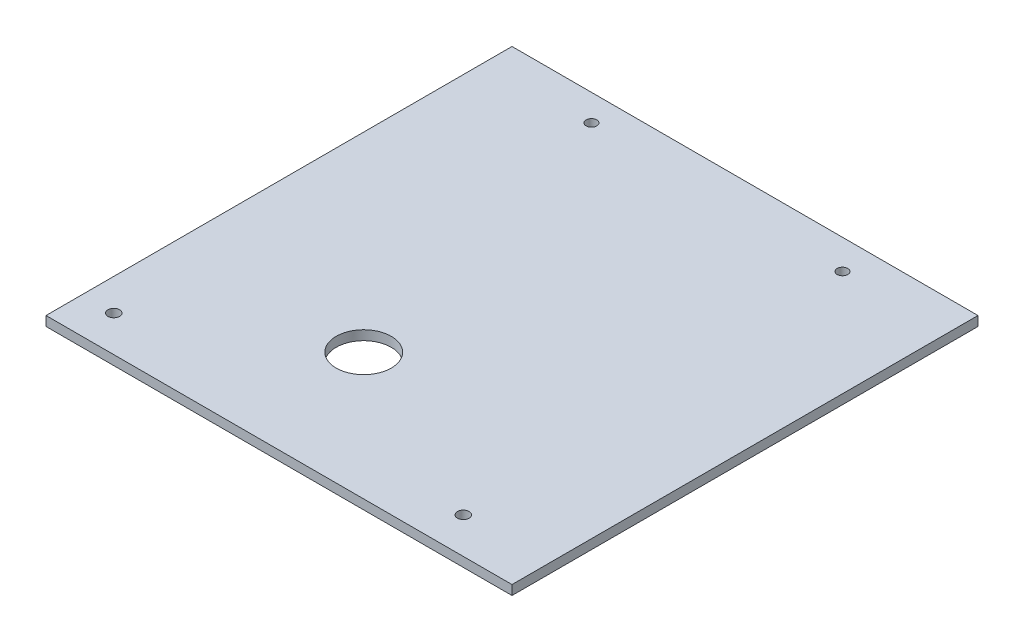
ISO-10303-21;
HEADER;
FILE_DESCRIPTION(('STEP AP214'),'2;1');
FILE_NAME('part.step','',(''),(''),'','','');
FILE_SCHEMA(('AUTOMOTIVE_DESIGN { 1 0 10303 214 1 1 1 1 }'));
ENDSEC;
DATA;
#1=APPLICATION_CONTEXT('core data for automotive mechanical design processes');
#2=APPLICATION_PROTOCOL_DEFINITION('international standard','automotive_design',2000,#1);
#3=PRODUCT_CONTEXT('',#1,'mechanical');
#4=PRODUCT('Part','Part','',(#3));
#5=PRODUCT_RELATED_PRODUCT_CATEGORY('part','',(#4));
#6=PRODUCT_DEFINITION_FORMATION('','',#4);
#7=PRODUCT_DEFINITION_CONTEXT('part definition',#1,'design');
#8=PRODUCT_DEFINITION('design','',#6,#7);
#9=PRODUCT_DEFINITION_SHAPE('','',#8);
#10=(LENGTH_UNIT() NAMED_UNIT(*) SI_UNIT(.MILLI.,.METRE.));
#11=(NAMED_UNIT(*) PLANE_ANGLE_UNIT() SI_UNIT($,.RADIAN.));
#12=(NAMED_UNIT(*) SI_UNIT($,.STERADIAN.) SOLID_ANGLE_UNIT());
#13=UNCERTAINTY_MEASURE_WITH_UNIT(LENGTH_MEASURE(1.E-05),#10,'distance_accuracy_value','');
#14=(GEOMETRIC_REPRESENTATION_CONTEXT(3) GLOBAL_UNCERTAINTY_ASSIGNED_CONTEXT((#13)) GLOBAL_UNIT_ASSIGNED_CONTEXT((#10,
#11,#12)) REPRESENTATION_CONTEXT('',''));
#15=CARTESIAN_POINT('',(0.,0.,0.));
#16=DIRECTION('',(0.,0.,1.));
#17=DIRECTION('',(1.,0.,0.));
#18=AXIS2_PLACEMENT_3D('',#15,#16,#17);
#19=CARTESIAN_POINT('',(110.,4.5,110.));
#20=DIRECTION('',(-1.,0.,0.));
#21=DIRECTION('',(0.,0.,1.));
#22=AXIS2_PLACEMENT_3D('',#19,#20,#21);
#23=PLANE('',#22);
#24=DIRECTION('',(0.,0.,-1.));
#25=VECTOR('',#24,1.);
#26=CARTESIAN_POINT('',(110.,0.,110.));
#27=LINE('',#26,#25);
#28=CARTESIAN_POINT('',(110.,0.,110.));
#29=VERTEX_POINT('',#28);
#30=CARTESIAN_POINT('',(110.,0.,-110.));
#31=VERTEX_POINT('',#30);
#32=EDGE_CURVE('E107',#29,#31,#27,.T.);
#33=ORIENTED_EDGE('',*,*,#32,.T.);
#34=DIRECTION('',(0.,-1.,0.));
#35=VECTOR('',#34,1.);
#36=CARTESIAN_POINT('',(110.,4.5,-110.));
#37=LINE('',#36,#35);
#38=CARTESIAN_POINT('',(110.,4.5,-110.));
#39=VERTEX_POINT('',#38);
#40=EDGE_CURVE('E13',#39,#31,#37,.T.);
#41=ORIENTED_EDGE('',*,*,#40,.F.);
#42=DIRECTION('',(0.,0.,-1.));
#43=VECTOR('',#42,1.);
#44=CARTESIAN_POINT('',(110.,4.5,110.));
#45=LINE('',#44,#43);
#46=CARTESIAN_POINT('',(110.,4.5,110.));
#47=VERTEX_POINT('',#46);
#48=EDGE_CURVE('E95',#47,#39,#45,.T.);
#49=ORIENTED_EDGE('',*,*,#48,.F.);
#50=DIRECTION('',(0.,-1.,0.));
#51=VECTOR('',#50,1.);
#52=CARTESIAN_POINT('',(110.,4.5,110.));
#53=LINE('',#52,#51);
#54=EDGE_CURVE('E103',#47,#29,#53,.T.);
#55=ORIENTED_EDGE('',*,*,#54,.T.);
#56=EDGE_LOOP('',(#33,#41,#49,#55));
#57=FACE_BOUND('',#56,.T.);
#58=ADVANCED_FACE('F44',(#57),#23,.F.);
#59=CARTESIAN_POINT('',(-110.,4.5,-110.));
#60=DIRECTION('',(0.,0.,1.));
#61=DIRECTION('',(1.,0.,0.));
#62=AXIS2_PLACEMENT_3D('',#59,#60,#61);
#63=PLANE('',#62);
#64=DIRECTION('',(-1.,0.,0.));
#65=VECTOR('',#64,1.);
#66=CARTESIAN_POINT('',(-110.,0.,-110.));
#67=LINE('',#66,#65);
#68=CARTESIAN_POINT('',(-110.,0.,-110.));
#69=VERTEX_POINT('',#68);
#70=EDGE_CURVE('E99',#31,#69,#67,.T.);
#71=ORIENTED_EDGE('',*,*,#70,.T.);
#72=DIRECTION('',(0.,-1.,0.));
#73=VECTOR('',#72,1.);
#74=CARTESIAN_POINT('',(-110.,4.5,-110.));
#75=LINE('',#74,#73);
#76=CARTESIAN_POINT('',(-110.,4.5,-110.));
#77=VERTEX_POINT('',#76);
#78=EDGE_CURVE('E52',#77,#69,#75,.T.);
#79=ORIENTED_EDGE('',*,*,#78,.F.);
#80=DIRECTION('',(-1.,0.,0.));
#81=VECTOR('',#80,1.);
#82=CARTESIAN_POINT('',(-110.,4.5,-110.));
#83=LINE('',#82,#81);
#84=EDGE_CURVE('E90',#39,#77,#83,.T.);
#85=ORIENTED_EDGE('',*,*,#84,.F.);
#86=ORIENTED_EDGE('',*,*,#40,.T.);
#87=EDGE_LOOP('',(#71,#79,#85,#86));
#88=FACE_BOUND('',#87,.T.);
#89=ADVANCED_FACE('F98',(#88),#63,.F.);
#90=CARTESIAN_POINT('',(-110.,4.5,110.));
#91=DIRECTION('',(1.,0.,0.));
#92=DIRECTION('',(0.,0.,-1.));
#93=AXIS2_PLACEMENT_3D('',#90,#91,#92);
#94=PLANE('',#93);
#95=DIRECTION('',(0.,0.,1.));
#96=VECTOR('',#95,1.);
#97=CARTESIAN_POINT('',(-110.,0.,110.));
#98=LINE('',#97,#96);
#99=CARTESIAN_POINT('',(-110.,0.,110.));
#100=VERTEX_POINT('',#99);
#101=EDGE_CURVE('E77',#69,#100,#98,.T.);
#102=ORIENTED_EDGE('',*,*,#101,.T.);
#103=DIRECTION('',(0.,-1.,0.));
#104=VECTOR('',#103,1.);
#105=CARTESIAN_POINT('',(-110.,4.5,110.));
#106=LINE('',#105,#104);
#107=CARTESIAN_POINT('',(-110.,4.5,110.));
#108=VERTEX_POINT('',#107);
#109=EDGE_CURVE('E100',#108,#100,#106,.T.);
#110=ORIENTED_EDGE('',*,*,#109,.F.);
#111=DIRECTION('',(0.,0.,1.));
#112=VECTOR('',#111,1.);
#113=CARTESIAN_POINT('',(-110.,4.5,110.));
#114=LINE('',#113,#112);
#115=EDGE_CURVE('E93',#77,#108,#114,.T.);
#116=ORIENTED_EDGE('',*,*,#115,.F.);
#117=ORIENTED_EDGE('',*,*,#78,.T.);
#118=EDGE_LOOP('',(#102,#110,#116,#117));
#119=FACE_BOUND('',#118,.T.);
#120=ADVANCED_FACE('F101',(#119),#94,.F.);
#121=CARTESIAN_POINT('',(-110.,4.5,110.));
#122=DIRECTION('',(0.,0.,-1.));
#123=DIRECTION('',(-1.,0.,0.));
#124=AXIS2_PLACEMENT_3D('',#121,#122,#123);
#125=PLANE('',#124);
#126=DIRECTION('',(1.,0.,0.));
#127=VECTOR('',#126,1.);
#128=CARTESIAN_POINT('',(-110.,0.,110.));
#129=LINE('',#128,#127);
#130=EDGE_CURVE('E83',#100,#29,#129,.T.);
#131=ORIENTED_EDGE('',*,*,#130,.T.);
#132=ORIENTED_EDGE('',*,*,#54,.F.);
#133=DIRECTION('',(1.,0.,0.));
#134=VECTOR('',#133,1.);
#135=CARTESIAN_POINT('',(-110.,4.5,110.));
#136=LINE('',#135,#134);
#137=EDGE_CURVE('E60',#108,#47,#136,.T.);
#138=ORIENTED_EDGE('',*,*,#137,.F.);
#139=ORIENTED_EDGE('',*,*,#109,.T.);
#140=EDGE_LOOP('',(#131,#132,#138,#139));
#141=FACE_BOUND('',#140,.T.);
#142=ADVANCED_FACE('F123',(#141),#125,.F.);
#143=CARTESIAN_POINT('',(0.,4.5,0.));
#144=DIRECTION('',(0.,-1.,0.));
#145=DIRECTION('',(0.,0.,-1.));
#146=AXIS2_PLACEMENT_3D('',#143,#144,#145);
#147=PLANE('',#146);
#148=CARTESIAN_POINT('',(-60.,4.5,-97.5));
#149=DIRECTION('',(0.,-1.,0.));
#150=DIRECTION('',(0.,0.,-1.));
#151=AXIS2_PLACEMENT_3D('',#148,#149,#150);
#152=CIRCLE('',#151,2.5);
#153=CARTESIAN_POINT('',(-60.,4.5,-100.));
#154=VERTEX_POINT('',#153);
#155=EDGE_CURVE('E152',#154,#154,#152,.F.);
#156=ORIENTED_EDGE('',*,*,#155,.F.);
#157=EDGE_LOOP('',(#156));
#158=FACE_BOUND('',#157,.T.);
#159=CARTESIAN_POINT('',(60.0000000000001,4.5,-96.));
#160=DIRECTION('',(0.,-1.,0.));
#161=DIRECTION('',(0.,0.,-1.));
#162=AXIS2_PLACEMENT_3D('',#159,#160,#161);
#163=CIRCLE('',#162,2.5);
#164=CARTESIAN_POINT('',(60.0000000000001,4.5,-98.5));
#165=VERTEX_POINT('',#164);
#166=EDGE_CURVE('E144',#165,#165,#163,.F.);
#167=ORIENTED_EDGE('',*,*,#166,.F.);
#168=EDGE_LOOP('',(#167));
#169=FACE_BOUND('',#168,.T.);
#170=CARTESIAN_POINT('',(70.,4.5,93.));
#171=DIRECTION('',(0.,1.,0.));
#172=DIRECTION('',(0.,0.,1.));
#173=AXIS2_PLACEMENT_3D('',#170,#171,#172);
#174=CIRCLE('',#173,2.75000000000001);
#175=CARTESIAN_POINT('',(70.,4.5,95.75));
#176=VERTEX_POINT('',#175);
#177=EDGE_CURVE('E138',#176,#176,#174,.T.);
#178=ORIENTED_EDGE('',*,*,#177,.F.);
#179=EDGE_LOOP('',(#178));
#180=FACE_BOUND('',#179,.T.);
#181=CARTESIAN_POINT('',(-95.,4.5,93.));
#182=DIRECTION('',(0.,1.,0.));
#183=DIRECTION('',(0.,0.,1.));
#184=AXIS2_PLACEMENT_3D('',#181,#182,#183);
#185=CIRCLE('',#184,2.75000000000001);
#186=CARTESIAN_POINT('',(-95.,4.5,95.75));
#187=VERTEX_POINT('',#186);
#188=EDGE_CURVE('E132',#187,#187,#185,.T.);
#189=ORIENTED_EDGE('',*,*,#188,.F.);
#190=EDGE_LOOP('',(#189));
#191=FACE_BOUND('',#190,.T.);
#192=CARTESIAN_POINT('',(-20.,4.5,50.));
#193=DIRECTION('',(0.,1.,0.));
#194=DIRECTION('',(0.,0.,1.));
#195=AXIS2_PLACEMENT_3D('',#192,#193,#194);
#196=CIRCLE('',#195,13.);
#197=CARTESIAN_POINT('',(-20.,4.5,63.));
#198=VERTEX_POINT('',#197);
#199=EDGE_CURVE('E111',#198,#198,#196,.T.);
#200=ORIENTED_EDGE('',*,*,#199,.F.);
#201=EDGE_LOOP('',(#200));
#202=FACE_BOUND('',#201,.T.);
#203=ORIENTED_EDGE('',*,*,#48,.T.);
#204=ORIENTED_EDGE('',*,*,#84,.T.);
#205=ORIENTED_EDGE('',*,*,#115,.T.);
#206=ORIENTED_EDGE('',*,*,#137,.T.);
#207=EDGE_LOOP('',(#203,#204,#205,#206));
#208=FACE_BOUND('',#207,.T.);
#209=ADVANCED_FACE('F91',(#158,#169,#180,#191,#202,#208),#147,.F.);
#210=CARTESIAN_POINT('',(0.,0.,0.));
#211=DIRECTION('',(0.,-1.,0.));
#212=DIRECTION('',(0.,0.,-1.));
#213=AXIS2_PLACEMENT_3D('',#210,#211,#212);
#214=PLANE('',#213);
#215=CARTESIAN_POINT('',(-60.,0.,-97.5));
#216=DIRECTION('',(0.,-1.,0.));
#217=DIRECTION('',(0.,0.,-1.));
#218=AXIS2_PLACEMENT_3D('',#215,#216,#217);
#219=CIRCLE('',#218,2.5);
#220=CARTESIAN_POINT('',(-60.,0.,-100.));
#221=VERTEX_POINT('',#220);
#222=EDGE_CURVE('E155',#221,#221,#219,.T.);
#223=ORIENTED_EDGE('',*,*,#222,.F.);
#224=EDGE_LOOP('',(#223));
#225=FACE_BOUND('',#224,.T.);
#226=CARTESIAN_POINT('',(60.0000000000001,0.,-96.));
#227=DIRECTION('',(0.,-1.,0.));
#228=DIRECTION('',(0.,0.,-1.));
#229=AXIS2_PLACEMENT_3D('',#226,#227,#228);
#230=CIRCLE('',#229,2.5);
#231=CARTESIAN_POINT('',(60.0000000000001,0.,-98.5));
#232=VERTEX_POINT('',#231);
#233=EDGE_CURVE('E149',#232,#232,#230,.T.);
#234=ORIENTED_EDGE('',*,*,#233,.F.);
#235=EDGE_LOOP('',(#234));
#236=FACE_BOUND('',#235,.T.);
#237=CARTESIAN_POINT('',(70.,0.,93.));
#238=DIRECTION('',(0.,-1.,0.));
#239=DIRECTION('',(0.,0.,-1.));
#240=AXIS2_PLACEMENT_3D('',#237,#238,#239);
#241=CIRCLE('',#240,2.75000000000001);
#242=CARTESIAN_POINT('',(70.,0.,90.25));
#243=VERTEX_POINT('',#242);
#244=EDGE_CURVE('E141',#243,#243,#241,.F.);
#245=ORIENTED_EDGE('',*,*,#244,.T.);
#246=EDGE_LOOP('',(#245));
#247=FACE_BOUND('',#246,.T.);
#248=CARTESIAN_POINT('',(-95.,0.,93.));
#249=DIRECTION('',(0.,-1.,0.));
#250=DIRECTION('',(0.,0.,-1.));
#251=AXIS2_PLACEMENT_3D('',#248,#249,#250);
#252=CIRCLE('',#251,2.75000000000001);
#253=CARTESIAN_POINT('',(-95.,0.,90.25));
#254=VERTEX_POINT('',#253);
#255=EDGE_CURVE('E135',#254,#254,#252,.F.);
#256=ORIENTED_EDGE('',*,*,#255,.T.);
#257=EDGE_LOOP('',(#256));
#258=FACE_BOUND('',#257,.T.);
#259=CARTESIAN_POINT('',(-20.,0.,50.));
#260=DIRECTION('',(0.,-1.,0.));
#261=DIRECTION('',(0.,0.,-1.));
#262=AXIS2_PLACEMENT_3D('',#259,#260,#261);
#263=CIRCLE('',#262,13.);
#264=CARTESIAN_POINT('',(-20.,0.,37.));
#265=VERTEX_POINT('',#264);
#266=EDGE_CURVE('E129',#265,#265,#263,.F.);
#267=ORIENTED_EDGE('',*,*,#266,.T.);
#268=EDGE_LOOP('',(#267));
#269=FACE_BOUND('',#268,.T.);
#270=ORIENTED_EDGE('',*,*,#32,.F.);
#271=ORIENTED_EDGE('',*,*,#130,.F.);
#272=ORIENTED_EDGE('',*,*,#101,.F.);
#273=ORIENTED_EDGE('',*,*,#70,.F.);
#274=EDGE_LOOP('',(#270,#271,#272,#273));
#275=FACE_BOUND('',#274,.T.);
#276=ADVANCED_FACE('F126',(#225,#236,#247,#258,#269,#275),#214,.T.);
#277=CARTESIAN_POINT('',(-20.,-0.00100000000000013,50.));
#278=DIRECTION('',(0.,1.,0.));
#279=DIRECTION('',(0.,0.,1.));
#280=AXIS2_PLACEMENT_3D('',#277,#278,#279);
#281=CYLINDRICAL_SURFACE('',#280,13.);
#282=ORIENTED_EDGE('',*,*,#266,.F.);
#283=EDGE_LOOP('',(#282));
#284=FACE_BOUND('',#283,.T.);
#285=ORIENTED_EDGE('',*,*,#199,.T.);
#286=EDGE_LOOP('',(#285));
#287=FACE_BOUND('',#286,.T.);
#288=ADVANCED_FACE('F164',(#284,#287),#281,.F.);
#289=CARTESIAN_POINT('',(-95.,-0.00100000000000013,93.));
#290=DIRECTION('',(0.,1.,0.));
#291=DIRECTION('',(0.,0.,1.));
#292=AXIS2_PLACEMENT_3D('',#289,#290,#291);
#293=CYLINDRICAL_SURFACE('',#292,2.75000000000001);
#294=ORIENTED_EDGE('',*,*,#255,.F.);
#295=EDGE_LOOP('',(#294));
#296=FACE_BOUND('',#295,.T.);
#297=ORIENTED_EDGE('',*,*,#188,.T.);
#298=EDGE_LOOP('',(#297));
#299=FACE_BOUND('',#298,.T.);
#300=ADVANCED_FACE('F176',(#296,#299),#293,.F.);
#301=CARTESIAN_POINT('',(70.,-0.00100000000000013,93.));
#302=DIRECTION('',(0.,1.,0.));
#303=DIRECTION('',(0.,0.,1.));
#304=AXIS2_PLACEMENT_3D('',#301,#302,#303);
#305=CYLINDRICAL_SURFACE('',#304,2.75000000000001);
#306=ORIENTED_EDGE('',*,*,#244,.F.);
#307=EDGE_LOOP('',(#306));
#308=FACE_BOUND('',#307,.T.);
#309=ORIENTED_EDGE('',*,*,#177,.T.);
#310=EDGE_LOOP('',(#309));
#311=FACE_BOUND('',#310,.T.);
#312=ADVANCED_FACE('F220',(#308,#311),#305,.F.);
#313=CARTESIAN_POINT('',(60.0000000000001,4.501,-96.));
#314=DIRECTION('',(0.,-1.,0.));
#315=DIRECTION('',(0.,0.,-1.));
#316=AXIS2_PLACEMENT_3D('',#313,#314,#315);
#317=CYLINDRICAL_SURFACE('',#316,2.5);
#318=ORIENTED_EDGE('',*,*,#233,.T.);
#319=EDGE_LOOP('',(#318));
#320=FACE_BOUND('',#319,.T.);
#321=ORIENTED_EDGE('',*,*,#166,.T.);
#322=EDGE_LOOP('',(#321));
#323=FACE_BOUND('',#322,.T.);
#324=ADVANCED_FACE('F229',(#320,#323),#317,.F.);
#325=CARTESIAN_POINT('',(-60.,4.501,-97.5));
#326=DIRECTION('',(0.,-1.,0.));
#327=DIRECTION('',(0.,0.,-1.));
#328=AXIS2_PLACEMENT_3D('',#325,#326,#327);
#329=CYLINDRICAL_SURFACE('',#328,2.5);
#330=ORIENTED_EDGE('',*,*,#222,.T.);
#331=EDGE_LOOP('',(#330));
#332=FACE_BOUND('',#331,.T.);
#333=ORIENTED_EDGE('',*,*,#155,.T.);
#334=EDGE_LOOP('',(#333));
#335=FACE_BOUND('',#334,.T.);
#336=ADVANCED_FACE('F159',(#332,#335),#329,.F.);
#337=CLOSED_SHELL('',(#58,#89,#120,#142,#209,#276,#288,#300,#312,#324,#336));
#338=MANIFOLD_SOLID_BREP('B2',#337);
#339=ADVANCED_BREP_SHAPE_REPRESENTATION('',(#18,#338),#14);
#340=SHAPE_DEFINITION_REPRESENTATION(#9,#339);
ENDSEC;
END-ISO-10303-21;
